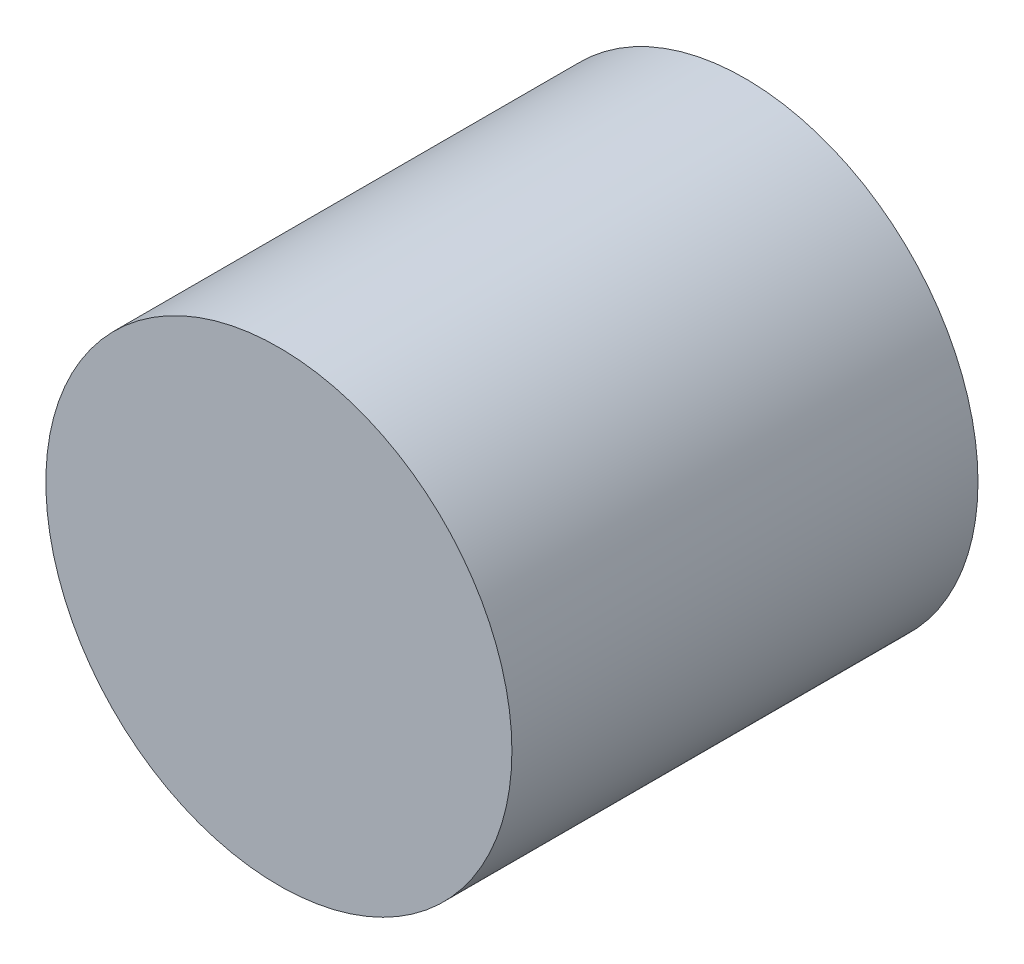
ISO-10303-21;
HEADER;
FILE_DESCRIPTION(('STEP AP214'),'2;1');
FILE_NAME('part.step','',(''),(''),'','','');
FILE_SCHEMA(('AUTOMOTIVE_DESIGN { 1 0 10303 214 1 1 1 1 }'));
ENDSEC;
DATA;
#1=APPLICATION_CONTEXT('core data for automotive mechanical design processes');
#2=APPLICATION_PROTOCOL_DEFINITION('international standard','automotive_design',2000,#1);
#3=PRODUCT_CONTEXT('',#1,'mechanical');
#4=PRODUCT('Part','Part','',(#3));
#5=PRODUCT_RELATED_PRODUCT_CATEGORY('part','',(#4));
#6=PRODUCT_DEFINITION_FORMATION('','',#4);
#7=PRODUCT_DEFINITION_CONTEXT('part definition',#1,'design');
#8=PRODUCT_DEFINITION('design','',#6,#7);
#9=PRODUCT_DEFINITION_SHAPE('','',#8);
#10=(LENGTH_UNIT() NAMED_UNIT(*) SI_UNIT(.MILLI.,.METRE.));
#11=(NAMED_UNIT(*) PLANE_ANGLE_UNIT() SI_UNIT($,.RADIAN.));
#12=(NAMED_UNIT(*) SI_UNIT($,.STERADIAN.) SOLID_ANGLE_UNIT());
#13=UNCERTAINTY_MEASURE_WITH_UNIT(LENGTH_MEASURE(1.E-05),#10,'distance_accuracy_value','');
#14=(GEOMETRIC_REPRESENTATION_CONTEXT(3) GLOBAL_UNCERTAINTY_ASSIGNED_CONTEXT((#13)) GLOBAL_UNIT_ASSIGNED_CONTEXT((#10,
#11,#12)) REPRESENTATION_CONTEXT('',''));
#15=CARTESIAN_POINT('',(0.,0.,0.));
#16=DIRECTION('',(0.,0.,1.));
#17=DIRECTION('',(1.,0.,0.));
#18=AXIS2_PLACEMENT_3D('',#15,#16,#17);
#19=CARTESIAN_POINT('',(0.,0.,25.4));
#20=DIRECTION('',(0.,0.,-1.));
#21=DIRECTION('',(-1.,0.,0.));
#22=AXIS2_PLACEMENT_3D('',#19,#20,#21);
#23=CYLINDRICAL_SURFACE('',#22,12.7);
#24=CARTESIAN_POINT('',(0.,0.,25.4));
#25=DIRECTION('',(0.,0.,1.));
#26=DIRECTION('',(1.,0.,0.));
#27=AXIS2_PLACEMENT_3D('',#24,#25,#26);
#28=CIRCLE('',#27,12.7);
#29=CARTESIAN_POINT('',(12.7,0.,25.4));
#30=VERTEX_POINT('',#29);
#31=EDGE_CURVE('E10',#30,#30,#28,.T.);
#32=ORIENTED_EDGE('',*,*,#31,.F.);
#33=EDGE_LOOP('',(#32));
#34=FACE_BOUND('',#33,.T.);
#35=CARTESIAN_POINT('',(0.,0.,0.));
#36=DIRECTION('',(0.,0.,1.));
#37=DIRECTION('',(1.,0.,0.));
#38=AXIS2_PLACEMENT_3D('',#35,#36,#37);
#39=CIRCLE('',#38,12.7);
#40=CARTESIAN_POINT('',(12.7,0.,0.));
#41=VERTEX_POINT('',#40);
#42=EDGE_CURVE('E37',#41,#41,#39,.T.);
#43=ORIENTED_EDGE('',*,*,#42,.T.);
#44=EDGE_LOOP('',(#43));
#45=FACE_BOUND('',#44,.T.);
#46=ADVANCED_FACE('F34',(#34,#45),#23,.T.);
#47=CARTESIAN_POINT('',(0.,0.,25.4));
#48=DIRECTION('',(0.,0.,1.));
#49=DIRECTION('',(1.,0.,0.));
#50=AXIS2_PLACEMENT_3D('',#47,#48,#49);
#51=PLANE('',#50);
#52=ORIENTED_EDGE('',*,*,#31,.T.);
#53=EDGE_LOOP('',(#52));
#54=FACE_BOUND('',#53,.T.);
#55=ADVANCED_FACE('F49',(#54),#51,.T.);
#56=CARTESIAN_POINT('',(0.,0.,0.));
#57=DIRECTION('',(0.,0.,1.));
#58=DIRECTION('',(1.,0.,0.));
#59=AXIS2_PLACEMENT_3D('',#56,#57,#58);
#60=PLANE('',#59);
#61=ORIENTED_EDGE('',*,*,#42,.F.);
#62=EDGE_LOOP('',(#61));
#63=FACE_BOUND('',#62,.T.);
#64=ADVANCED_FACE('F47',(#63),#60,.F.);
#65=CLOSED_SHELL('',(#46,#55,#64));
#66=MANIFOLD_SOLID_BREP('B2',#65);
#67=ADVANCED_BREP_SHAPE_REPRESENTATION('',(#18,#66),#14);
#68=SHAPE_DEFINITION_REPRESENTATION(#9,#67);
ENDSEC;
END-ISO-10303-21;
